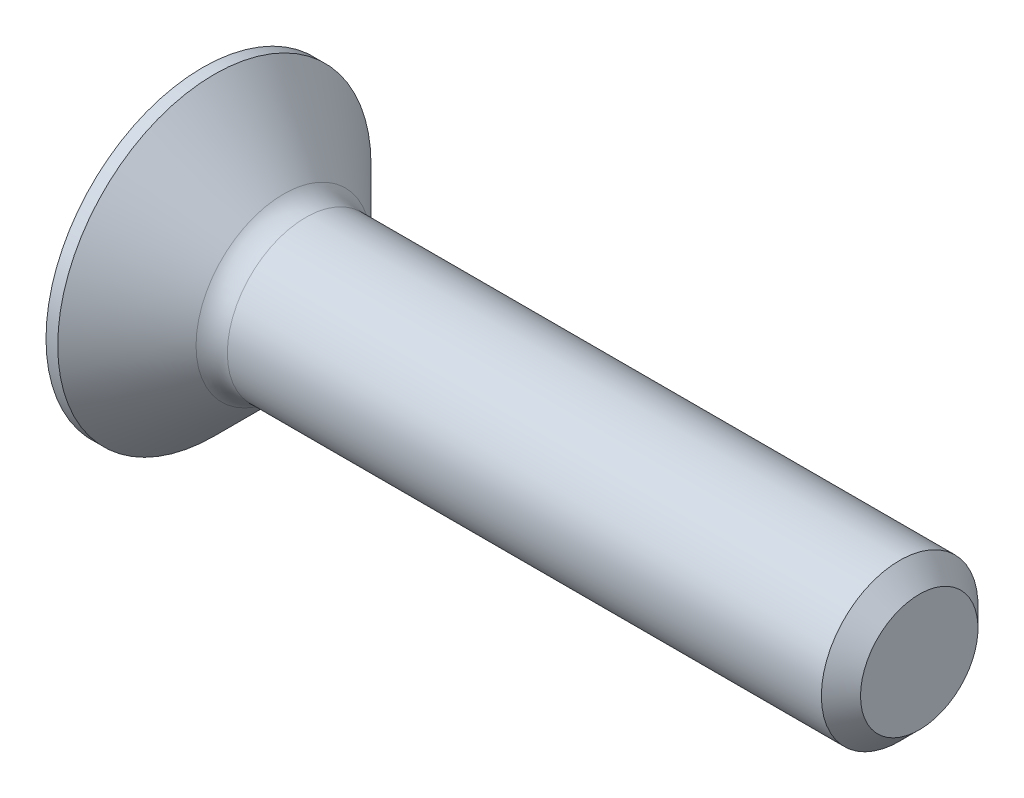
ISO-10303-21;
HEADER;
FILE_DESCRIPTION(('STEP AP214'),'2;1');
FILE_NAME('part.step','',(''),(''),'','','');
FILE_SCHEMA(('AUTOMOTIVE_DESIGN { 1 0 10303 214 1 1 1 1 }'));
ENDSEC;
DATA;
#1=APPLICATION_CONTEXT('core data for automotive mechanical design processes');
#2=APPLICATION_PROTOCOL_DEFINITION('international standard','automotive_design',2000,#1);
#3=PRODUCT_CONTEXT('',#1,'mechanical');
#4=PRODUCT('Part','Part','',(#3));
#5=PRODUCT_RELATED_PRODUCT_CATEGORY('part','',(#4));
#6=PRODUCT_DEFINITION_FORMATION('','',#4);
#7=PRODUCT_DEFINITION_CONTEXT('part definition',#1,'design');
#8=PRODUCT_DEFINITION('design','',#6,#7);
#9=PRODUCT_DEFINITION_SHAPE('','',#8);
#10=(LENGTH_UNIT() NAMED_UNIT(*) SI_UNIT(.MILLI.,.METRE.));
#11=(NAMED_UNIT(*) PLANE_ANGLE_UNIT() SI_UNIT($,.RADIAN.));
#12=(NAMED_UNIT(*) SI_UNIT($,.STERADIAN.) SOLID_ANGLE_UNIT());
#13=UNCERTAINTY_MEASURE_WITH_UNIT(LENGTH_MEASURE(1.E-05),#10,'distance_accuracy_value','');
#14=(GEOMETRIC_REPRESENTATION_CONTEXT(3) GLOBAL_UNCERTAINTY_ASSIGNED_CONTEXT((#13)) GLOBAL_UNIT_ASSIGNED_CONTEXT((#10,
#11,#12)) REPRESENTATION_CONTEXT('',''));
#15=CARTESIAN_POINT('',(0.,0.,0.));
#16=DIRECTION('',(0.,0.,1.));
#17=DIRECTION('',(1.,0.,0.));
#18=AXIS2_PLACEMENT_3D('',#15,#16,#17);
#19=CARTESIAN_POINT('',(0.,0.,0.));
#20=DIRECTION('',(-1.,0.,0.));
#21=DIRECTION('',(0.,0.,1.));
#22=AXIS2_PLACEMENT_3D('',#19,#20,#21);
#23=PLANE('',#22);
#24=CARTESIAN_POINT('',(0.,0.,0.));
#25=DIRECTION('',(-1.,0.,0.));
#26=DIRECTION('',(0.,0.,1.));
#27=AXIS2_PLACEMENT_3D('',#24,#25,#26);
#28=CIRCLE('',#27,4.);
#29=CARTESIAN_POINT('',(0.,0.,4.));
#30=VERTEX_POINT('',#29);
#31=EDGE_CURVE('E150',#30,#30,#28,.T.);
#32=ORIENTED_EDGE('',*,*,#31,.T.);
#33=EDGE_LOOP('',(#32));
#34=FACE_BOUND('',#33,.T.);
#35=DIRECTION('',(0.,-0.5,-0.866025403784439));
#36=VECTOR('',#35,1.);
#37=CARTESIAN_POINT('',(0.,-0.721687836487031,1.25));
#38=LINE('',#37,#36);
#39=CARTESIAN_POINT('',(0.,-0.721687836487031,1.25));
#40=VERTEX_POINT('',#39);
#41=CARTESIAN_POINT('',(0.,-1.44337567297406,0.));
#42=VERTEX_POINT('',#41);
#43=EDGE_CURVE('E51',#40,#42,#38,.T.);
#44=ORIENTED_EDGE('',*,*,#43,.T.);
#45=DIRECTION('',(0.,0.5,-0.866025403784439));
#46=VECTOR('',#45,1.);
#47=CARTESIAN_POINT('',(0.,-1.44337567297406,0.));
#48=LINE('',#47,#46);
#49=CARTESIAN_POINT('',(0.,-0.721687836487031,-1.25));
#50=VERTEX_POINT('',#49);
#51=EDGE_CURVE('E121',#42,#50,#48,.T.);
#52=ORIENTED_EDGE('',*,*,#51,.T.);
#53=DIRECTION('',(0.,1.,0.));
#54=VECTOR('',#53,1.);
#55=CARTESIAN_POINT('',(0.,-0.721687836487031,-1.25));
#56=LINE('',#55,#54);
#57=CARTESIAN_POINT('',(0.,0.721687836487033,-1.25));
#58=VERTEX_POINT('',#57);
#59=EDGE_CURVE('E123',#50,#58,#56,.T.);
#60=ORIENTED_EDGE('',*,*,#59,.T.);
#61=DIRECTION('',(0.,0.5,0.866025403784439));
#62=VECTOR('',#61,1.);
#63=CARTESIAN_POINT('',(0.,0.721687836487033,-1.25));
#64=LINE('',#63,#62);
#65=CARTESIAN_POINT('',(0.,1.44337567297407,0.));
#66=VERTEX_POINT('',#65);
#67=EDGE_CURVE('E125',#58,#66,#64,.T.);
#68=ORIENTED_EDGE('',*,*,#67,.T.);
#69=DIRECTION('',(0.,-0.5,0.866025403784439));
#70=VECTOR('',#69,1.);
#71=CARTESIAN_POINT('',(0.,1.44337567297407,0.));
#72=LINE('',#71,#70);
#73=CARTESIAN_POINT('',(0.,0.721687836487033,1.25));
#74=VERTEX_POINT('',#73);
#75=EDGE_CURVE('E127',#66,#74,#72,.T.);
#76=ORIENTED_EDGE('',*,*,#75,.T.);
#77=DIRECTION('',(0.,-1.,0.));
#78=VECTOR('',#77,1.);
#79=CARTESIAN_POINT('',(0.,0.721687836487033,1.25));
#80=LINE('',#79,#78);
#81=EDGE_CURVE('E80',#74,#40,#80,.T.);
#82=ORIENTED_EDGE('',*,*,#81,.T.);
#83=EDGE_LOOP('',(#44,#52,#60,#68,#76,#82));
#84=FACE_BOUND('',#83,.T.);
#85=ADVANCED_FACE('F36',(#34,#84),#23,.T.);
#86=CARTESIAN_POINT('',(0.,0.,0.));
#87=DIRECTION('',(-1.,0.,0.));
#88=DIRECTION('',(0.,0.,1.));
#89=AXIS2_PLACEMENT_3D('',#86,#87,#88);
#90=CYLINDRICAL_SURFACE('',#89,4.);
#91=CARTESIAN_POINT('',(0.300000000000008,0.,0.));
#92=DIRECTION('',(-1.,0.,0.));
#93=DIRECTION('',(0.,0.,1.));
#94=AXIS2_PLACEMENT_3D('',#91,#92,#93);
#95=CIRCLE('',#94,4.);
#96=CARTESIAN_POINT('',(0.300000000000008,0.,4.));
#97=VERTEX_POINT('',#96);
#98=EDGE_CURVE('E147',#97,#97,#95,.T.);
#99=ORIENTED_EDGE('',*,*,#98,.T.);
#100=EDGE_LOOP('',(#99));
#101=FACE_BOUND('',#100,.T.);
#102=ORIENTED_EDGE('',*,*,#31,.F.);
#103=EDGE_LOOP('',(#102));
#104=FACE_BOUND('',#103,.T.);
#105=ADVANCED_FACE('F174',(#101,#104),#90,.T.);
#106=CARTESIAN_POINT('',(0.300000000000008,0.,0.));
#107=DIRECTION('',(-1.,0.,0.));
#108=DIRECTION('',(0.,0.,1.));
#109=AXIS2_PLACEMENT_3D('',#106,#107,#108);
#110=CONICAL_SURFACE('',#109,4.,0.78539816339745);
#111=CARTESIAN_POINT('',(2.06568542494924,0.,0.));
#112=DIRECTION('',(-1.,0.,0.));
#113=DIRECTION('',(0.,0.,1.));
#114=AXIS2_PLACEMENT_3D('',#111,#112,#113);
#115=CIRCLE('',#114,2.23431457505076);
#116=CARTESIAN_POINT('',(2.06568542494924,0.,2.23431457505076));
#117=VERTEX_POINT('',#116);
#118=EDGE_CURVE('E44',#117,#117,#115,.T.);
#119=ORIENTED_EDGE('',*,*,#118,.T.);
#120=EDGE_LOOP('',(#119));
#121=FACE_BOUND('',#120,.T.);
#122=ORIENTED_EDGE('',*,*,#98,.F.);
#123=EDGE_LOOP('',(#122));
#124=FACE_BOUND('',#123,.T.);
#125=ADVANCED_FACE('F155',(#121,#124),#110,.T.);
#126=CARTESIAN_POINT('',(0.,0.,0.));
#127=DIRECTION('',(-1.,0.,0.));
#128=DIRECTION('',(0.,0.,1.));
#129=AXIS2_PLACEMENT_3D('',#126,#127,#128);
#130=CYLINDRICAL_SURFACE('',#129,2.);
#131=CARTESIAN_POINT('',(2.63137084989848,0.,0.));
#132=DIRECTION('',(-1.,0.,0.));
#133=DIRECTION('',(0.,0.,1.));
#134=AXIS2_PLACEMENT_3D('',#131,#132,#133);
#135=CIRCLE('',#134,2.);
#136=CARTESIAN_POINT('',(2.63137084989848,0.,2.));
#137=VERTEX_POINT('',#136);
#138=EDGE_CURVE('E11',#137,#137,#135,.F.);
#139=ORIENTED_EDGE('',*,*,#138,.T.);
#140=EDGE_LOOP('',(#139));
#141=FACE_BOUND('',#140,.T.);
#142=CARTESIAN_POINT('',(17.8,0.,0.));
#143=DIRECTION('',(-1.,0.,0.));
#144=DIRECTION('',(0.,0.,1.));
#145=AXIS2_PLACEMENT_3D('',#142,#143,#144);
#146=CIRCLE('',#145,2.);
#147=CARTESIAN_POINT('',(17.8,0.,2.));
#148=VERTEX_POINT('',#147);
#149=EDGE_CURVE('E144',#148,#148,#146,.T.);
#150=ORIENTED_EDGE('',*,*,#149,.T.);
#151=EDGE_LOOP('',(#150));
#152=FACE_BOUND('',#151,.T.);
#153=ADVANCED_FACE('F184',(#141,#152),#130,.T.);
#154=CARTESIAN_POINT('',(18.3,0.,0.));
#155=DIRECTION('',(-1.,0.,0.));
#156=DIRECTION('',(0.,0.,1.));
#157=AXIS2_PLACEMENT_3D('',#154,#155,#156);
#158=CONICAL_SURFACE('',#157,1.5,0.785398163397465);
#159=ORIENTED_EDGE('',*,*,#149,.F.);
#160=EDGE_LOOP('',(#159));
#161=FACE_BOUND('',#160,.T.);
#162=CARTESIAN_POINT('',(18.3,0.,0.));
#163=DIRECTION('',(-1.,0.,0.));
#164=DIRECTION('',(0.,0.,1.));
#165=AXIS2_PLACEMENT_3D('',#162,#163,#164);
#166=CIRCLE('',#165,1.5);
#167=CARTESIAN_POINT('',(18.3,0.,1.5));
#168=VERTEX_POINT('',#167);
#169=EDGE_CURVE('E141',#168,#168,#166,.T.);
#170=ORIENTED_EDGE('',*,*,#169,.T.);
#171=EDGE_LOOP('',(#170));
#172=FACE_BOUND('',#171,.T.);
#173=ADVANCED_FACE('F169',(#161,#172),#158,.T.);
#174=CARTESIAN_POINT('',(18.3,1.5,0.));
#175=DIRECTION('',(1.,0.,0.));
#176=DIRECTION('',(0.,0.,-1.));
#177=AXIS2_PLACEMENT_3D('',#174,#175,#176);
#178=PLANE('',#177);
#179=ORIENTED_EDGE('',*,*,#169,.F.);
#180=EDGE_LOOP('',(#179));
#181=FACE_BOUND('',#180,.T.);
#182=ADVANCED_FACE('F160',(#181),#178,.T.);
#183=CARTESIAN_POINT('',(2.63137084989848,0.,0.));
#184=DIRECTION('',(-1.,0.,0.));
#185=DIRECTION('',(0.,0.,1.));
#186=AXIS2_PLACEMENT_3D('',#183,#184,#185);
#187=TOROIDAL_SURFACE('',#186,2.8,0.8);
#188=ORIENTED_EDGE('',*,*,#138,.F.);
#189=EDGE_LOOP('',(#188));
#190=FACE_BOUND('',#189,.T.);
#191=ORIENTED_EDGE('',*,*,#118,.F.);
#192=EDGE_LOOP('',(#191));
#193=FACE_BOUND('',#192,.T.);
#194=ADVANCED_FACE('F38',(#190,#193),#187,.F.);
#195=CARTESIAN_POINT('',(5.6,-1.44337567297406,0.));
#196=DIRECTION('',(0.,0.866025403784439,0.5));
#197=DIRECTION('',(0.,-0.5,0.866025403784439));
#198=AXIS2_PLACEMENT_3D('',#195,#196,#197);
#199=PLANE('',#198);
#200=ORIENTED_EDGE('',*,*,#51,.F.);
#201=DIRECTION('',(-1.,0.,0.));
#202=VECTOR('',#201,1.);
#203=CARTESIAN_POINT('',(5.6,-1.44337567297406,0.));
#204=LINE('',#203,#202);
#205=CARTESIAN_POINT('',(5.6,-1.44337567297406,0.));
#206=VERTEX_POINT('',#205);
#207=EDGE_CURVE('E117',#206,#42,#204,.T.);
#208=ORIENTED_EDGE('',*,*,#207,.F.);
#209=DIRECTION('',(0.,0.5,-0.866025403784439));
#210=VECTOR('',#209,1.);
#211=CARTESIAN_POINT('',(5.6,-1.44337567297406,0.));
#212=LINE('',#211,#210);
#213=CARTESIAN_POINT('',(5.6,-0.721687836487031,-1.25));
#214=VERTEX_POINT('',#213);
#215=EDGE_CURVE('E131',#206,#214,#212,.T.);
#216=ORIENTED_EDGE('',*,*,#215,.T.);
#217=DIRECTION('',(-1.,0.,0.));
#218=VECTOR('',#217,1.);
#219=CARTESIAN_POINT('',(5.6,-0.721687836487031,-1.25));
#220=LINE('',#219,#218);
#221=EDGE_CURVE('E138',#214,#50,#220,.T.);
#222=ORIENTED_EDGE('',*,*,#221,.T.);
#223=EDGE_LOOP('',(#200,#208,#216,#222));
#224=FACE_BOUND('',#223,.T.);
#225=ADVANCED_FACE('F159',(#224),#199,.T.);
#226=CARTESIAN_POINT('',(5.6,-0.721687836487031,-1.25));
#227=DIRECTION('',(0.,0.,1.));
#228=DIRECTION('',(1.,0.,0.));
#229=AXIS2_PLACEMENT_3D('',#226,#227,#228);
#230=PLANE('',#229);
#231=ORIENTED_EDGE('',*,*,#59,.F.);
#232=ORIENTED_EDGE('',*,*,#221,.F.);
#233=DIRECTION('',(0.,1.,0.));
#234=VECTOR('',#233,1.);
#235=CARTESIAN_POINT('',(5.6,-0.721687836487031,-1.25));
#236=LINE('',#235,#234);
#237=CARTESIAN_POINT('',(5.6,0.721687836487033,-1.25));
#238=VERTEX_POINT('',#237);
#239=EDGE_CURVE('E89',#214,#238,#236,.T.);
#240=ORIENTED_EDGE('',*,*,#239,.T.);
#241=DIRECTION('',(-1.,0.,0.));
#242=VECTOR('',#241,1.);
#243=CARTESIAN_POINT('',(5.6,0.721687836487033,-1.25));
#244=LINE('',#243,#242);
#245=EDGE_CURVE('E135',#238,#58,#244,.T.);
#246=ORIENTED_EDGE('',*,*,#245,.T.);
#247=EDGE_LOOP('',(#231,#232,#240,#246));
#248=FACE_BOUND('',#247,.T.);
#249=ADVANCED_FACE('F166',(#248),#230,.T.);
#250=CARTESIAN_POINT('',(5.6,0.721687836487033,-1.25));
#251=DIRECTION('',(0.,-0.866025403784439,0.5));
#252=DIRECTION('',(0.,-0.5,-0.866025403784439));
#253=AXIS2_PLACEMENT_3D('',#250,#251,#252);
#254=PLANE('',#253);
#255=ORIENTED_EDGE('',*,*,#67,.F.);
#256=ORIENTED_EDGE('',*,*,#245,.F.);
#257=DIRECTION('',(0.,0.5,0.866025403784439));
#258=VECTOR('',#257,1.);
#259=CARTESIAN_POINT('',(5.6,0.721687836487033,-1.25));
#260=LINE('',#259,#258);
#261=CARTESIAN_POINT('',(5.6,1.44337567297407,0.));
#262=VERTEX_POINT('',#261);
#263=EDGE_CURVE('E109',#238,#262,#260,.T.);
#264=ORIENTED_EDGE('',*,*,#263,.T.);
#265=DIRECTION('',(-1.,0.,0.));
#266=VECTOR('',#265,1.);
#267=CARTESIAN_POINT('',(5.6,1.44337567297407,0.));
#268=LINE('',#267,#266);
#269=EDGE_CURVE('E106',#262,#66,#268,.T.);
#270=ORIENTED_EDGE('',*,*,#269,.T.);
#271=EDGE_LOOP('',(#255,#256,#264,#270));
#272=FACE_BOUND('',#271,.T.);
#273=ADVANCED_FACE('F193',(#272),#254,.T.);
#274=CARTESIAN_POINT('',(5.6,1.44337567297407,0.));
#275=DIRECTION('',(0.,-0.866025403784439,-0.5));
#276=DIRECTION('',(0.,0.5,-0.866025403784439));
#277=AXIS2_PLACEMENT_3D('',#274,#275,#276);
#278=PLANE('',#277);
#279=ORIENTED_EDGE('',*,*,#75,.F.);
#280=ORIENTED_EDGE('',*,*,#269,.F.);
#281=DIRECTION('',(0.,-0.5,0.866025403784439));
#282=VECTOR('',#281,1.);
#283=CARTESIAN_POINT('',(5.6,1.44337567297407,0.));
#284=LINE('',#283,#282);
#285=CARTESIAN_POINT('',(5.6,0.721687836487033,1.25));
#286=VERTEX_POINT('',#285);
#287=EDGE_CURVE('E100',#262,#286,#284,.T.);
#288=ORIENTED_EDGE('',*,*,#287,.T.);
#289=DIRECTION('',(-1.,0.,0.));
#290=VECTOR('',#289,1.);
#291=CARTESIAN_POINT('',(5.6,0.721687836487033,1.25));
#292=LINE('',#291,#290);
#293=EDGE_CURVE('E104',#286,#74,#292,.T.);
#294=ORIENTED_EDGE('',*,*,#293,.T.);
#295=EDGE_LOOP('',(#279,#280,#288,#294));
#296=FACE_BOUND('',#295,.T.);
#297=ADVANCED_FACE('F103',(#296),#278,.T.);
#298=CARTESIAN_POINT('',(5.6,0.721687836487033,1.25));
#299=DIRECTION('',(0.,0.,-1.));
#300=DIRECTION('',(-1.,0.,0.));
#301=AXIS2_PLACEMENT_3D('',#298,#299,#300);
#302=PLANE('',#301);
#303=ORIENTED_EDGE('',*,*,#81,.F.);
#304=ORIENTED_EDGE('',*,*,#293,.F.);
#305=DIRECTION('',(0.,-1.,0.));
#306=VECTOR('',#305,1.);
#307=CARTESIAN_POINT('',(5.6,0.721687836487033,1.25));
#308=LINE('',#307,#306);
#309=CARTESIAN_POINT('',(5.6,-0.721687836487031,1.25));
#310=VERTEX_POINT('',#309);
#311=EDGE_CURVE('E108',#286,#310,#308,.T.);
#312=ORIENTED_EDGE('',*,*,#311,.T.);
#313=DIRECTION('',(-1.,0.,0.));
#314=VECTOR('',#313,1.);
#315=CARTESIAN_POINT('',(5.6,-0.721687836487031,1.25));
#316=LINE('',#315,#314);
#317=EDGE_CURVE('E113',#310,#40,#316,.T.);
#318=ORIENTED_EDGE('',*,*,#317,.T.);
#319=EDGE_LOOP('',(#303,#304,#312,#318));
#320=FACE_BOUND('',#319,.T.);
#321=ADVANCED_FACE('F112',(#320),#302,.T.);
#322=CARTESIAN_POINT('',(5.6,-0.721687836487031,1.25));
#323=DIRECTION('',(0.,0.866025403784439,-0.5));
#324=DIRECTION('',(0.,0.5,0.866025403784439));
#325=AXIS2_PLACEMENT_3D('',#322,#323,#324);
#326=PLANE('',#325);
#327=ORIENTED_EDGE('',*,*,#43,.F.);
#328=ORIENTED_EDGE('',*,*,#317,.F.);
#329=DIRECTION('',(0.,-0.5,-0.866025403784439));
#330=VECTOR('',#329,1.);
#331=CARTESIAN_POINT('',(5.6,-0.721687836487031,1.25));
#332=LINE('',#331,#330);
#333=EDGE_CURVE('E60',#310,#206,#332,.T.);
#334=ORIENTED_EDGE('',*,*,#333,.T.);
#335=ORIENTED_EDGE('',*,*,#207,.T.);
#336=EDGE_LOOP('',(#327,#328,#334,#335));
#337=FACE_BOUND('',#336,.T.);
#338=ADVANCED_FACE('F202',(#337),#326,.T.);
#339=CARTESIAN_POINT('',(5.6,0.,-2.5));
#340=DIRECTION('',(1.,0.,0.));
#341=DIRECTION('',(0.,0.,-1.));
#342=AXIS2_PLACEMENT_3D('',#339,#340,#341);
#343=PLANE('',#342);
#344=ORIENTED_EDGE('',*,*,#215,.F.);
#345=ORIENTED_EDGE('',*,*,#333,.F.);
#346=ORIENTED_EDGE('',*,*,#311,.F.);
#347=ORIENTED_EDGE('',*,*,#287,.F.);
#348=ORIENTED_EDGE('',*,*,#263,.F.);
#349=ORIENTED_EDGE('',*,*,#239,.F.);
#350=EDGE_LOOP('',(#344,#345,#346,#347,#348,#349));
#351=FACE_BOUND('',#350,.T.);
#352=ADVANCED_FACE('F115',(#351),#343,.F.);
#353=CLOSED_SHELL('',(#85,#105,#125,#153,#173,#182,#194,#225,#249,#273,#297,#321,#338,#352));
#354=MANIFOLD_SOLID_BREP('B2',#353);
#355=ADVANCED_BREP_SHAPE_REPRESENTATION('',(#18,#354),#14);
#356=SHAPE_DEFINITION_REPRESENTATION(#9,#355);
ENDSEC;
END-ISO-10303-21;
